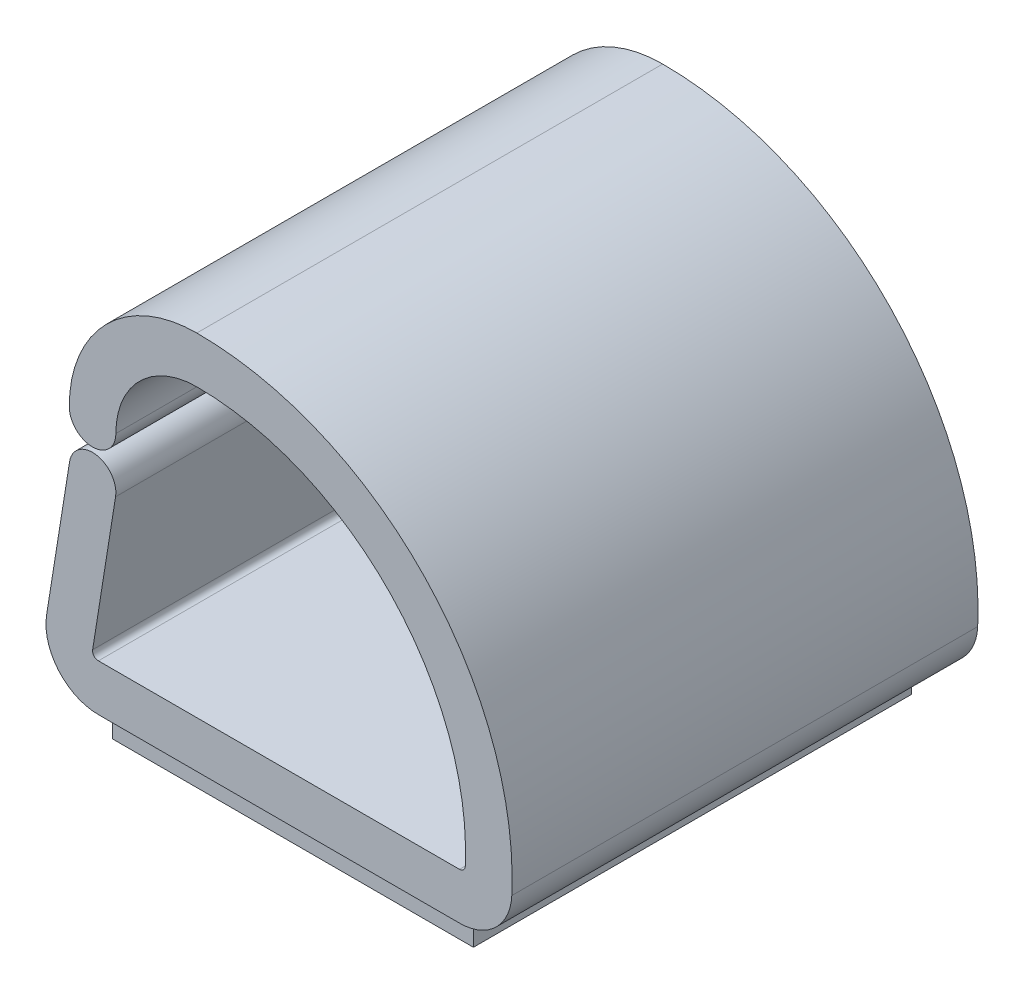
ISO-10303-21;
HEADER;
FILE_DESCRIPTION(('STEP AP214'),'2;1');
FILE_NAME('part.step','',(''),(''),'','','');
FILE_SCHEMA(('AUTOMOTIVE_DESIGN { 1 0 10303 214 1 1 1 1 }'));
ENDSEC;
DATA;
#1=APPLICATION_CONTEXT('core data for automotive mechanical design processes');
#2=APPLICATION_PROTOCOL_DEFINITION('international standard','automotive_design',2000,#1);
#3=PRODUCT_CONTEXT('',#1,'mechanical');
#4=PRODUCT('Part','Part','',(#3));
#5=PRODUCT_RELATED_PRODUCT_CATEGORY('part','',(#4));
#6=PRODUCT_DEFINITION_FORMATION('','',#4);
#7=PRODUCT_DEFINITION_CONTEXT('part definition',#1,'design');
#8=PRODUCT_DEFINITION('design','',#6,#7);
#9=PRODUCT_DEFINITION_SHAPE('','',#8);
#10=(LENGTH_UNIT() NAMED_UNIT(*) SI_UNIT(.MILLI.,.METRE.));
#11=(NAMED_UNIT(*) PLANE_ANGLE_UNIT() SI_UNIT($,.RADIAN.));
#12=(NAMED_UNIT(*) SI_UNIT($,.STERADIAN.) SOLID_ANGLE_UNIT());
#13=UNCERTAINTY_MEASURE_WITH_UNIT(LENGTH_MEASURE(1.E-05),#10,'distance_accuracy_value','');
#14=(GEOMETRIC_REPRESENTATION_CONTEXT(3) GLOBAL_UNCERTAINTY_ASSIGNED_CONTEXT((#13)) GLOBAL_UNIT_ASSIGNED_CONTEXT((#10,
#11,#12)) REPRESENTATION_CONTEXT('',''));
#15=CARTESIAN_POINT('',(0.,0.,0.));
#16=DIRECTION('',(0.,0.,1.));
#17=DIRECTION('',(1.,0.,0.));
#18=AXIS2_PLACEMENT_3D('',#15,#16,#17);
#19=CARTESIAN_POINT('',(-4.92125000000001,0.,6.35));
#20=DIRECTION('',(0.,1.,0.));
#21=DIRECTION('',(0.,0.,1.));
#22=AXIS2_PLACEMENT_3D('',#19,#20,#21);
#23=PLANE('',#22);
#24=DIRECTION('',(-1.,0.,0.));
#25=VECTOR('',#24,1.);
#26=CARTESIAN_POINT('',(4.92124999999999,0.,5.969));
#27=LINE('',#26,#25);
#28=CARTESIAN_POINT('',(4.92124999999999,0.,5.969));
#29=VERTEX_POINT('',#28);
#30=CARTESIAN_POINT('',(-4.92125000000001,0.,5.969));
#31=VERTEX_POINT('',#30);
#32=EDGE_CURVE('E181',#29,#31,#27,.T.);
#33=ORIENTED_EDGE('',*,*,#32,.F.);
#34=DIRECTION('',(0.,0.,-1.));
#35=VECTOR('',#34,1.);
#36=CARTESIAN_POINT('',(4.92124999999999,0.,6.35));
#37=LINE('',#36,#35);
#38=CARTESIAN_POINT('',(4.92124999999999,0.,6.35));
#39=VERTEX_POINT('',#38);
#40=EDGE_CURVE('E280',#39,#29,#37,.T.);
#41=ORIENTED_EDGE('',*,*,#40,.F.);
#42=DIRECTION('',(1.,0.,0.));
#43=VECTOR('',#42,1.);
#44=CARTESIAN_POINT('',(-4.92125000000001,0.,6.35));
#45=LINE('',#44,#43);
#46=CARTESIAN_POINT('',(-4.92125000000001,0.,6.35));
#47=VERTEX_POINT('',#46);
#48=EDGE_CURVE('E231',#47,#39,#45,.T.);
#49=ORIENTED_EDGE('',*,*,#48,.F.);
#50=DIRECTION('',(0.,0.,-1.));
#51=VECTOR('',#50,1.);
#52=CARTESIAN_POINT('',(-4.92125000000001,0.,6.35));
#53=LINE('',#52,#51);
#54=EDGE_CURVE('E11',#47,#31,#53,.T.);
#55=ORIENTED_EDGE('',*,*,#54,.T.);
#56=EDGE_LOOP('',(#33,#41,#49,#55));
#57=FACE_BOUND('',#56,.T.);
#58=ADVANCED_FACE('F32',(#57),#23,.F.);
#59=DIRECTION('',(1.,0.,0.));
#60=VECTOR('',#59,1.);
#61=CARTESIAN_POINT('',(-4.92125000000001,0.,-5.96899999999999));
#62=LINE('',#61,#60);
#63=CARTESIAN_POINT('',(-4.92125000000001,0.,-5.96899999999999));
#64=VERTEX_POINT('',#63);
#65=CARTESIAN_POINT('',(4.92124999999999,0.,-5.96899999999999));
#66=VERTEX_POINT('',#65);
#67=EDGE_CURVE('E300',#64,#66,#62,.T.);
#68=ORIENTED_EDGE('',*,*,#67,.F.);
#69=CARTESIAN_POINT('',(-4.92125000000001,0.,-6.34999999999999));
#70=VERTEX_POINT('',#69);
#71=EDGE_CURVE('E40',#64,#70,#53,.T.);
#72=ORIENTED_EDGE('',*,*,#71,.T.);
#73=DIRECTION('',(1.,0.,0.));
#74=VECTOR('',#73,1.);
#75=CARTESIAN_POINT('',(-4.92125000000001,0.,-6.34999999999999));
#76=LINE('',#75,#74);
#77=CARTESIAN_POINT('',(4.92124999999999,0.,-6.34999999999999));
#78=VERTEX_POINT('',#77);
#79=EDGE_CURVE('E186',#70,#78,#76,.T.);
#80=ORIENTED_EDGE('',*,*,#79,.T.);
#81=EDGE_CURVE('E279',#66,#78,#37,.T.);
#82=ORIENTED_EDGE('',*,*,#81,.F.);
#83=EDGE_LOOP('',(#68,#72,#80,#82));
#84=FACE_BOUND('',#83,.T.);
#85=ADVANCED_FACE('F298',(#84),#23,.F.);
#86=CARTESIAN_POINT('',(-4.92125000000001,1.42875,6.35));
#87=DIRECTION('',(0.,0.,-1.));
#88=DIRECTION('',(-1.,0.,0.));
#89=AXIS2_PLACEMENT_3D('',#86,#87,#88);
#90=CYLINDRICAL_SURFACE('',#89,1.42875);
#91=DIRECTION('',(0.,0.,-1.));
#92=VECTOR('',#91,1.);
#93=CARTESIAN_POINT('',(-6.33220162866148,1.65356562240543,6.35));
#94=LINE('',#93,#92);
#95=CARTESIAN_POINT('',(-6.33220162866148,1.65356562240543,6.35));
#96=VERTEX_POINT('',#95);
#97=CARTESIAN_POINT('',(-6.33220162866148,1.65356562240543,-6.34999999999999));
#98=VERTEX_POINT('',#97);
#99=EDGE_CURVE('E256',#96,#98,#94,.T.);
#100=ORIENTED_EDGE('',*,*,#99,.T.);
#101=CARTESIAN_POINT('',(-4.92125000000001,1.42875,-6.34999999999999));
#102=DIRECTION('',(0.,0.,1.));
#103=DIRECTION('',(-1.,0.,0.));
#104=AXIS2_PLACEMENT_3D('',#101,#102,#103);
#105=CIRCLE('',#104,1.42875);
#106=EDGE_CURVE('E183',#98,#70,#105,.T.);
#107=ORIENTED_EDGE('',*,*,#106,.T.);
#108=ORIENTED_EDGE('',*,*,#71,.F.);
#109=DIRECTION('',(0.,0.,-1.));
#110=VECTOR('',#109,1.);
#111=CARTESIAN_POINT('',(-4.92125000000001,0.,5.969));
#112=LINE('',#111,#110);
#113=EDGE_CURVE('E303',#31,#64,#112,.T.);
#114=ORIENTED_EDGE('',*,*,#113,.F.);
#115=ORIENTED_EDGE('',*,*,#54,.F.);
#116=CARTESIAN_POINT('',(-4.92125000000001,1.42875,6.35));
#117=DIRECTION('',(0.,0.,1.));
#118=DIRECTION('',(-1.,0.,0.));
#119=AXIS2_PLACEMENT_3D('',#116,#117,#118);
#120=CIRCLE('',#119,1.42875);
#121=EDGE_CURVE('E229',#96,#47,#120,.T.);
#122=ORIENTED_EDGE('',*,*,#121,.F.);
#123=EDGE_LOOP('',(#100,#107,#108,#114,#115,#122));
#124=FACE_BOUND('',#123,.T.);
#125=ADVANCED_FACE('F34',(#124),#90,.T.);
#126=CARTESIAN_POINT('',(4.92124999999999,1.42875,6.35));
#127=DIRECTION('',(0.,0.,-1.));
#128=DIRECTION('',(-1.,0.,0.));
#129=AXIS2_PLACEMENT_3D('',#126,#127,#128);
#130=CYLINDRICAL_SURFACE('',#129,1.42875);
#131=ORIENTED_EDGE('',*,*,#40,.T.);
#132=DIRECTION('',(0.,0.,1.));
#133=VECTOR('',#132,1.);
#134=CARTESIAN_POINT('',(4.92124999999999,0.,-5.96899999999999));
#135=LINE('',#134,#133);
#136=EDGE_CURVE('E177',#66,#29,#135,.T.);
#137=ORIENTED_EDGE('',*,*,#136,.F.);
#138=ORIENTED_EDGE('',*,*,#81,.T.);
#139=CARTESIAN_POINT('',(4.92124999999999,1.42875,-6.34999999999999));
#140=DIRECTION('',(0.,0.,1.));
#141=DIRECTION('',(1.,0.,0.));
#142=AXIS2_PLACEMENT_3D('',#139,#140,#141);
#143=CIRCLE('',#142,1.42875);
#144=CARTESIAN_POINT('',(6.34852158393655,1.36377009397328,-6.34999999999999));
#145=VERTEX_POINT('',#144);
#146=EDGE_CURVE('E193',#78,#145,#143,.T.);
#147=ORIENTED_EDGE('',*,*,#146,.T.);
#148=DIRECTION('',(0.,0.,-1.));
#149=VECTOR('',#148,1.);
#150=CARTESIAN_POINT('',(6.34852158393655,1.36377009397328,6.35));
#151=LINE('',#150,#149);
#152=CARTESIAN_POINT('',(6.34852158393655,1.36377009397328,6.35));
#153=VERTEX_POINT('',#152);
#154=EDGE_CURVE('E278',#153,#145,#151,.T.);
#155=ORIENTED_EDGE('',*,*,#154,.F.);
#156=CARTESIAN_POINT('',(4.92124999999999,1.42875,6.35));
#157=DIRECTION('',(0.,0.,1.));
#158=DIRECTION('',(1.,0.,0.));
#159=AXIS2_PLACEMENT_3D('',#156,#157,#158);
#160=CIRCLE('',#159,1.42875);
#161=EDGE_CURVE('E233',#39,#153,#160,.T.);
#162=ORIENTED_EDGE('',*,*,#161,.F.);
#163=EDGE_LOOP('',(#131,#137,#138,#147,#155,#162));
#164=FACE_BOUND('',#163,.T.);
#165=ADVANCED_FACE('F288',(#164),#130,.T.);
#166=CARTESIAN_POINT('',(-2.23837500000001,1.75470881885593,6.35));
#167=DIRECTION('',(0.,0.,-1.));
#168=DIRECTION('',(-1.,0.,0.));
#169=AXIS2_PLACEMENT_3D('',#166,#167,#168);
#170=CYLINDRICAL_SURFACE('',#169,8.59579118114407);
#171=ORIENTED_EDGE('',*,*,#154,.T.);
#172=CARTESIAN_POINT('',(-2.23837500000001,1.75470881885593,-6.34999999999999));
#173=DIRECTION('',(0.,0.,1.));
#174=DIRECTION('',(1.,0.,0.));
#175=AXIS2_PLACEMENT_3D('',#172,#173,#174);
#176=CIRCLE('',#175,8.59579118114407);
#177=CARTESIAN_POINT('',(-2.23837500000001,10.3505,-6.34999999999999));
#178=VERTEX_POINT('',#177);
#179=EDGE_CURVE('E196',#145,#178,#176,.T.);
#180=ORIENTED_EDGE('',*,*,#179,.T.);
#181=DIRECTION('',(0.,0.,-1.));
#182=VECTOR('',#181,1.);
#183=CARTESIAN_POINT('',(-2.23837500000001,10.3505,6.35));
#184=LINE('',#183,#182);
#185=CARTESIAN_POINT('',(-2.23837500000001,10.3505,6.35));
#186=VERTEX_POINT('',#185);
#187=EDGE_CURVE('E276',#186,#178,#184,.T.);
#188=ORIENTED_EDGE('',*,*,#187,.F.);
#189=CARTESIAN_POINT('',(-2.23837500000001,1.75470881885593,6.35));
#190=DIRECTION('',(0.,0.,1.));
#191=DIRECTION('',(1.,0.,0.));
#192=AXIS2_PLACEMENT_3D('',#189,#190,#191);
#193=CIRCLE('',#192,8.59579118114407);
#194=EDGE_CURVE('E235',#153,#186,#193,.T.);
#195=ORIENTED_EDGE('',*,*,#194,.F.);
#196=EDGE_LOOP('',(#171,#180,#188,#195));
#197=FACE_BOUND('',#196,.T.);
#198=ADVANCED_FACE('F354',(#197),#170,.T.);
#199=CARTESIAN_POINT('',(-2.23837500000001,6.873875,6.35));
#200=DIRECTION('',(0.,0.,-1.));
#201=DIRECTION('',(-1.,0.,0.));
#202=AXIS2_PLACEMENT_3D('',#199,#200,#201);
#203=CYLINDRICAL_SURFACE('',#202,3.476625);
#204=ORIENTED_EDGE('',*,*,#187,.T.);
#205=CARTESIAN_POINT('',(-2.23837500000001,6.873875,-6.34999999999999));
#206=DIRECTION('',(0.,0.,1.));
#207=DIRECTION('',(1.,0.,0.));
#208=AXIS2_PLACEMENT_3D('',#205,#206,#207);
#209=CIRCLE('',#208,3.476625);
#210=CARTESIAN_POINT('',(-5.71500000000001,6.873875,-6.34999999999999));
#211=VERTEX_POINT('',#210);
#212=EDGE_CURVE('E199',#178,#211,#209,.T.);
#213=ORIENTED_EDGE('',*,*,#212,.T.);
#214=DIRECTION('',(0.,0.,-1.));
#215=VECTOR('',#214,1.);
#216=CARTESIAN_POINT('',(-5.71500000000001,6.873875,6.35));
#217=LINE('',#216,#215);
#218=CARTESIAN_POINT('',(-5.71500000000001,6.873875,6.35));
#219=VERTEX_POINT('',#218);
#220=EDGE_CURVE('E274',#219,#211,#217,.T.);
#221=ORIENTED_EDGE('',*,*,#220,.F.);
#222=CARTESIAN_POINT('',(-2.23837500000001,6.873875,6.35));
#223=DIRECTION('',(0.,0.,1.));
#224=DIRECTION('',(1.,0.,0.));
#225=AXIS2_PLACEMENT_3D('',#222,#223,#224);
#226=CIRCLE('',#225,3.476625);
#227=EDGE_CURVE('E237',#186,#219,#226,.T.);
#228=ORIENTED_EDGE('',*,*,#227,.F.);
#229=EDGE_LOOP('',(#204,#213,#221,#228));
#230=FACE_BOUND('',#229,.T.);
#231=ADVANCED_FACE('F351',(#230),#203,.T.);
#232=CARTESIAN_POINT('',(-5.08000000000001,6.873875,6.35));
#233=DIRECTION('',(0.,0.,-1.));
#234=DIRECTION('',(-1.,0.,0.));
#235=AXIS2_PLACEMENT_3D('',#232,#233,#234);
#236=CYLINDRICAL_SURFACE('',#235,0.635);
#237=ORIENTED_EDGE('',*,*,#220,.T.);
#238=CARTESIAN_POINT('',(-5.08000000000001,6.873875,-6.34999999999999));
#239=DIRECTION('',(0.,0.,1.));
#240=DIRECTION('',(-1.,0.,0.));
#241=AXIS2_PLACEMENT_3D('',#238,#239,#240);
#242=CIRCLE('',#241,0.635);
#243=CARTESIAN_POINT('',(-4.44500000000001,6.873875,-6.34999999999999));
#244=VERTEX_POINT('',#243);
#245=EDGE_CURVE('E202',#211,#244,#242,.T.);
#246=ORIENTED_EDGE('',*,*,#245,.T.);
#247=DIRECTION('',(0.,0.,-1.));
#248=VECTOR('',#247,1.);
#249=CARTESIAN_POINT('',(-4.44500000000001,6.873875,6.35));
#250=LINE('',#249,#248);
#251=CARTESIAN_POINT('',(-4.44500000000001,6.873875,6.35));
#252=VERTEX_POINT('',#251);
#253=EDGE_CURVE('E272',#252,#244,#250,.T.);
#254=ORIENTED_EDGE('',*,*,#253,.F.);
#255=CARTESIAN_POINT('',(-5.08000000000001,6.873875,6.35));
#256=DIRECTION('',(0.,0.,1.));
#257=DIRECTION('',(-1.,0.,0.));
#258=AXIS2_PLACEMENT_3D('',#255,#256,#257);
#259=CIRCLE('',#258,0.635);
#260=EDGE_CURVE('E239',#219,#252,#259,.T.);
#261=ORIENTED_EDGE('',*,*,#260,.F.);
#262=EDGE_LOOP('',(#237,#246,#254,#261));
#263=FACE_BOUND('',#262,.T.);
#264=ADVANCED_FACE('F346',(#263),#236,.T.);
#265=CARTESIAN_POINT('',(-2.23837500000001,6.873875,6.35));
#266=DIRECTION('',(0.,0.,-1.));
#267=DIRECTION('',(-1.,0.,0.));
#268=AXIS2_PLACEMENT_3D('',#265,#266,#267);
#269=CYLINDRICAL_SURFACE('',#268,2.206625);
#270=ORIENTED_EDGE('',*,*,#253,.T.);
#271=CARTESIAN_POINT('',(-2.23837500000001,6.873875,-6.34999999999999));
#272=DIRECTION('',(0.,0.,-1.));
#273=DIRECTION('',(1.,0.,0.));
#274=AXIS2_PLACEMENT_3D('',#271,#272,#273);
#275=CIRCLE('',#274,2.206625);
#276=CARTESIAN_POINT('',(-2.23837500000001,9.0805,-6.34999999999999));
#277=VERTEX_POINT('',#276);
#278=EDGE_CURVE('E205',#244,#277,#275,.T.);
#279=ORIENTED_EDGE('',*,*,#278,.T.);
#280=DIRECTION('',(0.,0.,-1.));
#281=VECTOR('',#280,1.);
#282=CARTESIAN_POINT('',(-2.23837500000001,9.0805,6.35));
#283=LINE('',#282,#281);
#284=CARTESIAN_POINT('',(-2.23837500000001,9.0805,6.35));
#285=VERTEX_POINT('',#284);
#286=EDGE_CURVE('E270',#285,#277,#283,.T.);
#287=ORIENTED_EDGE('',*,*,#286,.F.);
#288=CARTESIAN_POINT('',(-2.23837500000001,6.873875,6.35));
#289=DIRECTION('',(0.,0.,-1.));
#290=DIRECTION('',(1.,0.,0.));
#291=AXIS2_PLACEMENT_3D('',#288,#289,#290);
#292=CIRCLE('',#291,2.206625);
#293=EDGE_CURVE('E241',#252,#285,#292,.T.);
#294=ORIENTED_EDGE('',*,*,#293,.F.);
#295=EDGE_LOOP('',(#270,#279,#287,#294));
#296=FACE_BOUND('',#295,.T.);
#297=ADVANCED_FACE('F342',(#296),#269,.F.);
#298=CARTESIAN_POINT('',(-2.23837500000001,1.75470881885593,6.35));
#299=DIRECTION('',(0.,0.,-1.));
#300=DIRECTION('',(-1.,0.,0.));
#301=AXIS2_PLACEMENT_3D('',#298,#299,#300);
#302=CYLINDRICAL_SURFACE('',#301,7.32579118114407);
#303=ORIENTED_EDGE('',*,*,#286,.T.);
#304=CARTESIAN_POINT('',(-2.23837500000001,1.75470881885593,-6.34999999999999));
#305=DIRECTION('',(0.,0.,-1.));
#306=DIRECTION('',(1.,0.,0.));
#307=AXIS2_PLACEMENT_3D('',#304,#305,#306);
#308=CIRCLE('',#307,7.32579118114407);
#309=CARTESIAN_POINT('',(5.0798357315485,1.42153001044147,-6.34999999999999));
#310=VERTEX_POINT('',#309);
#311=EDGE_CURVE('E208',#277,#310,#308,.T.);
#312=ORIENTED_EDGE('',*,*,#311,.T.);
#313=DIRECTION('',(0.,0.,-1.));
#314=VECTOR('',#313,1.);
#315=CARTESIAN_POINT('',(5.0798357315485,1.42153001044147,6.35));
#316=LINE('',#315,#314);
#317=CARTESIAN_POINT('',(5.0798357315485,1.42153001044147,6.35));
#318=VERTEX_POINT('',#317);
#319=EDGE_CURVE('E268',#318,#310,#316,.T.);
#320=ORIENTED_EDGE('',*,*,#319,.F.);
#321=CARTESIAN_POINT('',(-2.23837500000001,1.75470881885593,6.35));
#322=DIRECTION('',(0.,0.,-1.));
#323=DIRECTION('',(1.,0.,0.));
#324=AXIS2_PLACEMENT_3D('',#321,#322,#323);
#325=CIRCLE('',#324,7.32579118114407);
#326=EDGE_CURVE('E243',#285,#318,#325,.T.);
#327=ORIENTED_EDGE('',*,*,#326,.F.);
#328=EDGE_LOOP('',(#303,#312,#320,#327));
#329=FACE_BOUND('',#328,.T.);
#330=ADVANCED_FACE('F337',(#329),#302,.F.);
#331=CARTESIAN_POINT('',(4.92124999999999,1.42875,6.35));
#332=DIRECTION('',(0.,0.,-1.));
#333=DIRECTION('',(-1.,0.,0.));
#334=AXIS2_PLACEMENT_3D('',#331,#332,#333);
#335=CYLINDRICAL_SURFACE('',#334,0.158750000000001);
#336=ORIENTED_EDGE('',*,*,#319,.T.);
#337=CARTESIAN_POINT('',(4.92124999999999,1.42875,-6.34999999999999));
#338=DIRECTION('',(0.,0.,-1.));
#339=DIRECTION('',(1.,0.,0.));
#340=AXIS2_PLACEMENT_3D('',#337,#338,#339);
#341=CIRCLE('',#340,0.158750000000001);
#342=CARTESIAN_POINT('',(4.92124999999999,1.27,-6.34999999999999));
#343=VERTEX_POINT('',#342);
#344=EDGE_CURVE('E211',#310,#343,#341,.T.);
#345=ORIENTED_EDGE('',*,*,#344,.T.);
#346=DIRECTION('',(0.,0.,-1.));
#347=VECTOR('',#346,1.);
#348=CARTESIAN_POINT('',(4.92124999999999,1.27,6.35));
#349=LINE('',#348,#347);
#350=CARTESIAN_POINT('',(4.92124999999999,1.27,6.35));
#351=VERTEX_POINT('',#350);
#352=EDGE_CURVE('E266',#351,#343,#349,.T.);
#353=ORIENTED_EDGE('',*,*,#352,.F.);
#354=CARTESIAN_POINT('',(4.92124999999999,1.42875,6.35));
#355=DIRECTION('',(0.,0.,-1.));
#356=DIRECTION('',(1.,0.,0.));
#357=AXIS2_PLACEMENT_3D('',#354,#355,#356);
#358=CIRCLE('',#357,0.158750000000001);
#359=EDGE_CURVE('E245',#318,#351,#358,.T.);
#360=ORIENTED_EDGE('',*,*,#359,.F.);
#361=EDGE_LOOP('',(#336,#345,#353,#360));
#362=FACE_BOUND('',#361,.T.);
#363=ADVANCED_FACE('F332',(#362),#335,.F.);
#364=CARTESIAN_POINT('',(-4.92125000000001,1.27,6.35));
#365=DIRECTION('',(0.,-1.,0.));
#366=DIRECTION('',(1.,0.,0.));
#367=AXIS2_PLACEMENT_3D('',#364,#365,#366);
#368=PLANE('',#367);
#369=ORIENTED_EDGE('',*,*,#352,.T.);
#370=DIRECTION('',(-1.,0.,0.));
#371=VECTOR('',#370,1.);
#372=CARTESIAN_POINT('',(-4.92125000000001,1.27,-6.34999999999999));
#373=LINE('',#372,#371);
#374=CARTESIAN_POINT('',(-4.92125000000001,1.27,-6.34999999999999));
#375=VERTEX_POINT('',#374);
#376=EDGE_CURVE('E214',#343,#375,#373,.T.);
#377=ORIENTED_EDGE('',*,*,#376,.T.);
#378=DIRECTION('',(0.,0.,-1.));
#379=VECTOR('',#378,1.);
#380=CARTESIAN_POINT('',(-4.92125000000001,1.27,6.35));
#381=LINE('',#380,#379);
#382=CARTESIAN_POINT('',(-4.92125000000001,1.27,6.35));
#383=VERTEX_POINT('',#382);
#384=EDGE_CURVE('E264',#383,#375,#381,.T.);
#385=ORIENTED_EDGE('',*,*,#384,.F.);
#386=DIRECTION('',(-1.,0.,0.));
#387=VECTOR('',#386,1.);
#388=CARTESIAN_POINT('',(-4.92125000000001,1.27,6.35));
#389=LINE('',#388,#387);
#390=EDGE_CURVE('E247',#351,#383,#389,.T.);
#391=ORIENTED_EDGE('',*,*,#390,.F.);
#392=EDGE_LOOP('',(#369,#377,#385,#391));
#393=FACE_BOUND('',#392,.T.);
#394=ADVANCED_FACE('F327',(#393),#368,.F.);
#395=CARTESIAN_POINT('',(-4.92125000000001,1.42875,6.35));
#396=DIRECTION('',(0.,0.,-1.));
#397=DIRECTION('',(-1.,0.,0.));
#398=AXIS2_PLACEMENT_3D('',#395,#396,#397);
#399=CYLINDRICAL_SURFACE('',#398,0.15875);
#400=ORIENTED_EDGE('',*,*,#384,.T.);
#401=CARTESIAN_POINT('',(-4.92125000000001,1.42875,-6.34999999999999));
#402=DIRECTION('',(0.,0.,-1.));
#403=DIRECTION('',(-1.,0.,0.));
#404=AXIS2_PLACEMENT_3D('',#401,#402,#403);
#405=CIRCLE('',#404,0.15875);
#406=CARTESIAN_POINT('',(-5.07802240318462,1.4537295136006,-6.34999999999999));
#407=VERTEX_POINT('',#406);
#408=EDGE_CURVE('E217',#375,#407,#405,.T.);
#409=ORIENTED_EDGE('',*,*,#408,.T.);
#410=DIRECTION('',(0.,0.,-1.));
#411=VECTOR('',#410,1.);
#412=CARTESIAN_POINT('',(-5.07802240318462,1.4537295136006,6.35));
#413=LINE('',#412,#411);
#414=CARTESIAN_POINT('',(-5.07802240318462,1.4537295136006,6.35));
#415=VERTEX_POINT('',#414);
#416=EDGE_CURVE('E262',#415,#407,#413,.T.);
#417=ORIENTED_EDGE('',*,*,#416,.F.);
#418=CARTESIAN_POINT('',(-4.92125000000001,1.42875,6.35));
#419=DIRECTION('',(0.,0.,-1.));
#420=DIRECTION('',(-1.,0.,0.));
#421=AXIS2_PLACEMENT_3D('',#418,#419,#420);
#422=CIRCLE('',#421,0.15875);
#423=EDGE_CURVE('E249',#383,#415,#422,.T.);
#424=ORIENTED_EDGE('',*,*,#423,.F.);
#425=EDGE_LOOP('',(#400,#409,#417,#424));
#426=FACE_BOUND('',#425,.T.);
#427=ADVANCED_FACE('F322',(#426),#399,.F.);
#428=CARTESIAN_POINT('',(-4.45291038726158,5.37695694559758,6.35));
#429=DIRECTION('',(-0.987542697225877,0.157351266775456,0.));
#430=DIRECTION('',(-0.157351266775456,-0.987542697225877,0.));
#431=AXIS2_PLACEMENT_3D('',#428,#429,#430);
#432=PLANE('',#431);
#433=ORIENTED_EDGE('',*,*,#416,.T.);
#434=DIRECTION('',(0.157351266775456,0.987542697225877,0.));
#435=VECTOR('',#434,1.);
#436=CARTESIAN_POINT('',(-4.45291038726158,5.37695694559758,-6.34999999999999));
#437=LINE('',#436,#435);
#438=CARTESIAN_POINT('',(-4.45291038726158,5.37695694559758,-6.34999999999999));
#439=VERTEX_POINT('',#438);
#440=EDGE_CURVE('E220',#407,#439,#437,.T.);
#441=ORIENTED_EDGE('',*,*,#440,.T.);
#442=DIRECTION('',(0.,0.,-1.));
#443=VECTOR('',#442,1.);
#444=CARTESIAN_POINT('',(-4.45291038726158,5.37695694559758,6.35));
#445=LINE('',#444,#443);
#446=CARTESIAN_POINT('',(-4.45291038726158,5.37695694559758,6.35));
#447=VERTEX_POINT('',#446);
#448=EDGE_CURVE('E260',#447,#439,#445,.T.);
#449=ORIENTED_EDGE('',*,*,#448,.F.);
#450=DIRECTION('',(0.157351266775456,0.987542697225877,0.));
#451=VECTOR('',#450,1.);
#452=CARTESIAN_POINT('',(-4.45291038726158,5.37695694559758,6.35));
#453=LINE('',#452,#451);
#454=EDGE_CURVE('E251',#415,#447,#453,.T.);
#455=ORIENTED_EDGE('',*,*,#454,.F.);
#456=EDGE_LOOP('',(#433,#441,#449,#455));
#457=FACE_BOUND('',#456,.T.);
#458=ADVANCED_FACE('F317',(#457),#432,.F.);
#459=CARTESIAN_POINT('',(-5.08000000000001,5.476875,6.35));
#460=DIRECTION('',(0.,0.,-1.));
#461=DIRECTION('',(-1.,0.,0.));
#462=AXIS2_PLACEMENT_3D('',#459,#460,#461);
#463=CYLINDRICAL_SURFACE('',#462,0.635);
#464=ORIENTED_EDGE('',*,*,#448,.T.);
#465=CARTESIAN_POINT('',(-5.08000000000001,5.476875,-6.34999999999999));
#466=DIRECTION('',(0.,0.,1.));
#467=DIRECTION('',(-1.,0.,0.));
#468=AXIS2_PLACEMENT_3D('',#465,#466,#467);
#469=CIRCLE('',#468,0.635);
#470=CARTESIAN_POINT('',(-5.70708961273844,5.57679305440241,-6.34999999999999));
#471=VERTEX_POINT('',#470);
#472=EDGE_CURVE('E223',#439,#471,#469,.T.);
#473=ORIENTED_EDGE('',*,*,#472,.T.);
#474=DIRECTION('',(0.,0.,-1.));
#475=VECTOR('',#474,1.);
#476=CARTESIAN_POINT('',(-5.70708961273844,5.57679305440241,6.35));
#477=LINE('',#476,#475);
#478=CARTESIAN_POINT('',(-5.70708961273844,5.57679305440241,6.35));
#479=VERTEX_POINT('',#478);
#480=EDGE_CURVE('E258',#479,#471,#477,.T.);
#481=ORIENTED_EDGE('',*,*,#480,.F.);
#482=CARTESIAN_POINT('',(-5.08000000000001,5.476875,6.35));
#483=DIRECTION('',(0.,0.,1.));
#484=DIRECTION('',(-1.,0.,0.));
#485=AXIS2_PLACEMENT_3D('',#482,#483,#484);
#486=CIRCLE('',#485,0.635);
#487=EDGE_CURVE('E253',#447,#479,#486,.T.);
#488=ORIENTED_EDGE('',*,*,#487,.F.);
#489=EDGE_LOOP('',(#464,#473,#481,#488));
#490=FACE_BOUND('',#489,.T.);
#491=ADVANCED_FACE('F312',(#490),#463,.T.);
#492=CARTESIAN_POINT('',(-6.33220162866148,1.65356562240543,6.35));
#493=DIRECTION('',(0.987542697225877,-0.157351266775456,0.));
#494=DIRECTION('',(0.157351266775456,0.987542697225877,0.));
#495=AXIS2_PLACEMENT_3D('',#492,#493,#494);
#496=PLANE('',#495);
#497=ORIENTED_EDGE('',*,*,#480,.T.);
#498=DIRECTION('',(-0.157351266775456,-0.987542697225877,0.));
#499=VECTOR('',#498,1.);
#500=CARTESIAN_POINT('',(-6.33220162866148,1.65356562240543,-6.34999999999999));
#501=LINE('',#500,#499);
#502=EDGE_CURVE('E226',#471,#98,#501,.T.);
#503=ORIENTED_EDGE('',*,*,#502,.T.);
#504=ORIENTED_EDGE('',*,*,#99,.F.);
#505=DIRECTION('',(-0.157351266775456,-0.987542697225877,0.));
#506=VECTOR('',#505,1.);
#507=CARTESIAN_POINT('',(-6.33220162866148,1.65356562240543,6.35));
#508=LINE('',#507,#506);
#509=EDGE_CURVE('E55',#479,#96,#508,.T.);
#510=ORIENTED_EDGE('',*,*,#509,.F.);
#511=EDGE_LOOP('',(#497,#503,#504,#510));
#512=FACE_BOUND('',#511,.T.);
#513=ADVANCED_FACE('F308',(#512),#496,.F.);
#514=CARTESIAN_POINT('',(-4.92125000000001,1.42875,6.35));
#515=DIRECTION('',(0.,0.,-1.));
#516=DIRECTION('',(-1.,0.,0.));
#517=AXIS2_PLACEMENT_3D('',#514,#515,#516);
#518=PLANE('',#517);
#519=ORIENTED_EDGE('',*,*,#121,.T.);
#520=ORIENTED_EDGE('',*,*,#48,.T.);
#521=ORIENTED_EDGE('',*,*,#161,.T.);
#522=ORIENTED_EDGE('',*,*,#194,.T.);
#523=ORIENTED_EDGE('',*,*,#227,.T.);
#524=ORIENTED_EDGE('',*,*,#260,.T.);
#525=ORIENTED_EDGE('',*,*,#293,.T.);
#526=ORIENTED_EDGE('',*,*,#326,.T.);
#527=ORIENTED_EDGE('',*,*,#359,.T.);
#528=ORIENTED_EDGE('',*,*,#390,.T.);
#529=ORIENTED_EDGE('',*,*,#423,.T.);
#530=ORIENTED_EDGE('',*,*,#454,.T.);
#531=ORIENTED_EDGE('',*,*,#487,.T.);
#532=ORIENTED_EDGE('',*,*,#509,.T.);
#533=EDGE_LOOP('',(#519,#520,#521,#522,#523,#524,#525,#526,#527,#528,#529,#530,#531,#532));
#534=FACE_BOUND('',#533,.T.);
#535=ADVANCED_FACE('F356',(#534),#518,.F.);
#536=CARTESIAN_POINT('',(-4.92125000000001,1.42875,-6.34999999999999));
#537=DIRECTION('',(0.,0.,-1.));
#538=DIRECTION('',(-1.,0.,0.));
#539=AXIS2_PLACEMENT_3D('',#536,#537,#538);
#540=PLANE('',#539);
#541=ORIENTED_EDGE('',*,*,#106,.F.);
#542=ORIENTED_EDGE('',*,*,#502,.F.);
#543=ORIENTED_EDGE('',*,*,#472,.F.);
#544=ORIENTED_EDGE('',*,*,#440,.F.);
#545=ORIENTED_EDGE('',*,*,#408,.F.);
#546=ORIENTED_EDGE('',*,*,#376,.F.);
#547=ORIENTED_EDGE('',*,*,#344,.F.);
#548=ORIENTED_EDGE('',*,*,#311,.F.);
#549=ORIENTED_EDGE('',*,*,#278,.F.);
#550=ORIENTED_EDGE('',*,*,#245,.F.);
#551=ORIENTED_EDGE('',*,*,#212,.F.);
#552=ORIENTED_EDGE('',*,*,#179,.F.);
#553=ORIENTED_EDGE('',*,*,#146,.F.);
#554=ORIENTED_EDGE('',*,*,#79,.F.);
#555=EDGE_LOOP('',(#541,#542,#543,#544,#545,#546,#547,#548,#549,#550,#551,#552,#553,#554));
#556=FACE_BOUND('',#555,.T.);
#557=ADVANCED_FACE('F296',(#556),#540,.T.);
#558=CARTESIAN_POINT('',(4.92124999999999,-0.762,5.969));
#559=DIRECTION('',(0.,0.,-1.));
#560=DIRECTION('',(-1.,0.,0.));
#561=AXIS2_PLACEMENT_3D('',#558,#559,#560);
#562=PLANE('',#561);
#563=ORIENTED_EDGE('',*,*,#32,.T.);
#564=DIRECTION('',(0.,1.,0.));
#565=VECTOR('',#564,1.);
#566=CARTESIAN_POINT('',(-4.92125000000001,-0.762,5.969));
#567=LINE('',#566,#565);
#568=CARTESIAN_POINT('',(-4.92125000000001,-0.762,5.969));
#569=VERTEX_POINT('',#568);
#570=EDGE_CURVE('E162',#569,#31,#567,.T.);
#571=ORIENTED_EDGE('',*,*,#570,.F.);
#572=DIRECTION('',(-1.,0.,0.));
#573=VECTOR('',#572,1.);
#574=CARTESIAN_POINT('',(4.92124999999999,-0.762,5.969));
#575=LINE('',#574,#573);
#576=CARTESIAN_POINT('',(4.92124999999999,-0.762,5.969));
#577=VERTEX_POINT('',#576);
#578=EDGE_CURVE('E169',#577,#569,#575,.T.);
#579=ORIENTED_EDGE('',*,*,#578,.F.);
#580=DIRECTION('',(0.,1.,0.));
#581=VECTOR('',#580,1.);
#582=CARTESIAN_POINT('',(4.92124999999999,-0.762,5.969));
#583=LINE('',#582,#581);
#584=EDGE_CURVE('E365',#577,#29,#583,.T.);
#585=ORIENTED_EDGE('',*,*,#584,.T.);
#586=EDGE_LOOP('',(#563,#571,#579,#585));
#587=FACE_BOUND('',#586,.T.);
#588=ADVANCED_FACE('F179',(#587),#562,.F.);
#589=CARTESIAN_POINT('',(-4.92125000000001,-0.762,5.969));
#590=DIRECTION('',(1.,0.,0.));
#591=DIRECTION('',(0.,1.,0.));
#592=AXIS2_PLACEMENT_3D('',#589,#590,#591);
#593=PLANE('',#592);
#594=ORIENTED_EDGE('',*,*,#113,.T.);
#595=DIRECTION('',(0.,1.,0.));
#596=VECTOR('',#595,1.);
#597=CARTESIAN_POINT('',(-4.92125000000001,-0.762,-5.96899999999999));
#598=LINE('',#597,#596);
#599=CARTESIAN_POINT('',(-4.92125000000001,-0.762,-5.96899999999999));
#600=VERTEX_POINT('',#599);
#601=EDGE_CURVE('E165',#600,#64,#598,.T.);
#602=ORIENTED_EDGE('',*,*,#601,.F.);
#603=DIRECTION('',(0.,0.,-1.));
#604=VECTOR('',#603,1.);
#605=CARTESIAN_POINT('',(-4.92125000000001,-0.762,5.969));
#606=LINE('',#605,#604);
#607=EDGE_CURVE('E158',#569,#600,#606,.T.);
#608=ORIENTED_EDGE('',*,*,#607,.F.);
#609=ORIENTED_EDGE('',*,*,#570,.T.);
#610=EDGE_LOOP('',(#594,#602,#608,#609));
#611=FACE_BOUND('',#610,.T.);
#612=ADVANCED_FACE('F160',(#611),#593,.F.);
#613=CARTESIAN_POINT('',(-4.92125000000001,-0.762,-5.96899999999999));
#614=DIRECTION('',(0.,0.,1.));
#615=DIRECTION('',(1.,0.,0.));
#616=AXIS2_PLACEMENT_3D('',#613,#614,#615);
#617=PLANE('',#616);
#618=ORIENTED_EDGE('',*,*,#67,.T.);
#619=DIRECTION('',(0.,1.,0.));
#620=VECTOR('',#619,1.);
#621=CARTESIAN_POINT('',(4.92124999999999,-0.762,-5.96899999999999));
#622=LINE('',#621,#620);
#623=CARTESIAN_POINT('',(4.92124999999999,-0.762,-5.96899999999999));
#624=VERTEX_POINT('',#623);
#625=EDGE_CURVE('E47',#624,#66,#622,.T.);
#626=ORIENTED_EDGE('',*,*,#625,.F.);
#627=DIRECTION('',(1.,0.,0.));
#628=VECTOR('',#627,1.);
#629=CARTESIAN_POINT('',(-4.92125000000001,-0.762,-5.96899999999999));
#630=LINE('',#629,#628);
#631=EDGE_CURVE('E168',#600,#624,#630,.T.);
#632=ORIENTED_EDGE('',*,*,#631,.F.);
#633=ORIENTED_EDGE('',*,*,#601,.T.);
#634=EDGE_LOOP('',(#618,#626,#632,#633));
#635=FACE_BOUND('',#634,.T.);
#636=ADVANCED_FACE('F367',(#635),#617,.F.);
#637=CARTESIAN_POINT('',(4.92124999999999,-0.762,-5.96899999999999));
#638=DIRECTION('',(-1.,0.,0.));
#639=DIRECTION('',(0.,-1.,0.));
#640=AXIS2_PLACEMENT_3D('',#637,#638,#639);
#641=PLANE('',#640);
#642=ORIENTED_EDGE('',*,*,#136,.T.);
#643=ORIENTED_EDGE('',*,*,#584,.F.);
#644=DIRECTION('',(0.,0.,1.));
#645=VECTOR('',#644,1.);
#646=CARTESIAN_POINT('',(4.92124999999999,-0.762,-5.96899999999999));
#647=LINE('',#646,#645);
#648=EDGE_CURVE('E173',#624,#577,#647,.T.);
#649=ORIENTED_EDGE('',*,*,#648,.F.);
#650=ORIENTED_EDGE('',*,*,#625,.T.);
#651=EDGE_LOOP('',(#642,#643,#649,#650));
#652=FACE_BOUND('',#651,.T.);
#653=ADVANCED_FACE('F368',(#652),#641,.F.);
#654=CARTESIAN_POINT('',(0.,-0.762,0.));
#655=DIRECTION('',(0.,-1.,0.));
#656=DIRECTION('',(1.,0.,0.));
#657=AXIS2_PLACEMENT_3D('',#654,#655,#656);
#658=PLANE('',#657);
#659=ORIENTED_EDGE('',*,*,#578,.T.);
#660=ORIENTED_EDGE('',*,*,#607,.T.);
#661=ORIENTED_EDGE('',*,*,#631,.T.);
#662=ORIENTED_EDGE('',*,*,#648,.T.);
#663=EDGE_LOOP('',(#659,#660,#661,#662));
#664=FACE_BOUND('',#663,.T.);
#665=ADVANCED_FACE('F172',(#664),#658,.T.);
#666=CLOSED_SHELL('',(#58,#85,#125,#165,#198,#231,#264,#297,#330,#363,#394,#427,#458,#491,#513,
#535,#557,#588,#612,#636,#653,#665));
#667=MANIFOLD_SOLID_BREP('B2',#666);
#668=ADVANCED_BREP_SHAPE_REPRESENTATION('',(#18,#667),#14);
#669=SHAPE_DEFINITION_REPRESENTATION(#9,#668);
ENDSEC;
END-ISO-10303-21;
